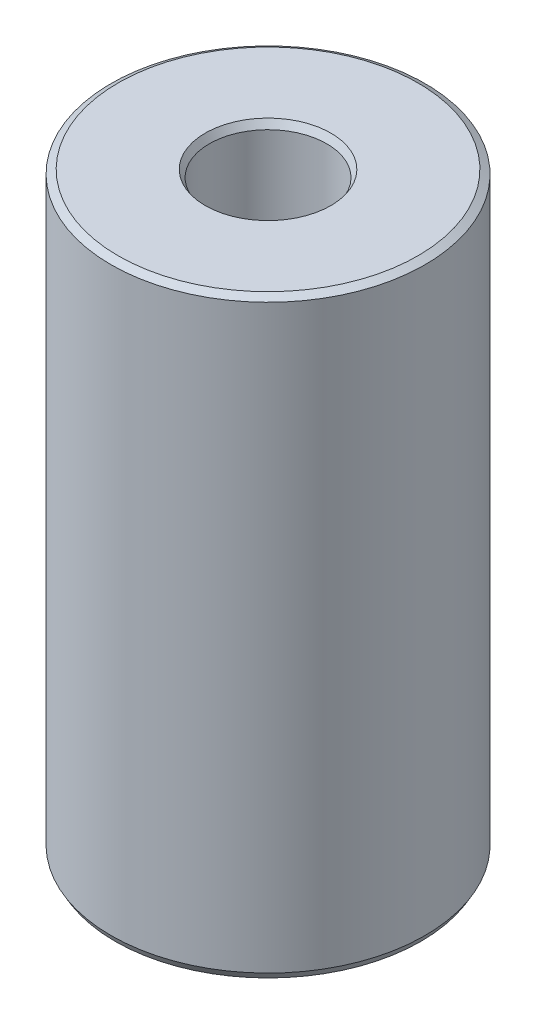
ISO-10303-21;
HEADER;
FILE_DESCRIPTION(('STEP AP214'),'2;1');
FILE_NAME('part.step','',(''),(''),'','','');
FILE_SCHEMA(('AUTOMOTIVE_DESIGN { 1 0 10303 214 1 1 1 1 }'));
ENDSEC;
DATA;
#1=APPLICATION_CONTEXT('core data for automotive mechanical design processes');
#2=APPLICATION_PROTOCOL_DEFINITION('international standard','automotive_design',2000,#1);
#3=PRODUCT_CONTEXT('',#1,'mechanical');
#4=PRODUCT('Part','Part','',(#3));
#5=PRODUCT_RELATED_PRODUCT_CATEGORY('part','',(#4));
#6=PRODUCT_DEFINITION_FORMATION('','',#4);
#7=PRODUCT_DEFINITION_CONTEXT('part definition',#1,'design');
#8=PRODUCT_DEFINITION('design','',#6,#7);
#9=PRODUCT_DEFINITION_SHAPE('','',#8);
#10=(LENGTH_UNIT() NAMED_UNIT(*) SI_UNIT(.MILLI.,.METRE.));
#11=(NAMED_UNIT(*) PLANE_ANGLE_UNIT() SI_UNIT($,.RADIAN.));
#12=(NAMED_UNIT(*) SI_UNIT($,.STERADIAN.) SOLID_ANGLE_UNIT());
#13=UNCERTAINTY_MEASURE_WITH_UNIT(LENGTH_MEASURE(1.E-05),#10,'distance_accuracy_value','');
#14=(GEOMETRIC_REPRESENTATION_CONTEXT(3) GLOBAL_UNCERTAINTY_ASSIGNED_CONTEXT((#13)) GLOBAL_UNIT_ASSIGNED_CONTEXT((#10,
#11,#12)) REPRESENTATION_CONTEXT('',''));
#15=CARTESIAN_POINT('',(0.,0.,0.));
#16=DIRECTION('',(0.,0.,1.));
#17=DIRECTION('',(1.,0.,0.));
#18=AXIS2_PLACEMENT_3D('',#15,#16,#17);
#19=CARTESIAN_POINT('',(0.,94.3124489131097,0.));
#20=DIRECTION('',(0.,-1.,0.));
#21=DIRECTION('',(0.,0.,-1.));
#22=AXIS2_PLACEMENT_3D('',#19,#20,#21);
#23=CYLINDRICAL_SURFACE('',#22,25.);
#24=CARTESIAN_POINT('',(0.,1.13805154253697,0.));
#25=DIRECTION('',(0.,1.,0.));
#26=DIRECTION('',(0.,0.,1.));
#27=AXIS2_PLACEMENT_3D('',#24,#25,#26);
#28=CIRCLE('',#27,25.);
#29=CARTESIAN_POINT('',(0.,1.13805154253697,25.));
#30=VERTEX_POINT('',#29);
#31=EDGE_CURVE('E10',#30,#30,#28,.T.);
#32=ORIENTED_EDGE('',*,*,#31,.T.);
#33=EDGE_LOOP('',(#32));
#34=FACE_BOUND('',#33,.T.);
#35=CARTESIAN_POINT('',(0.,93.6553945486743,0.));
#36=DIRECTION('',(0.,1.,0.));
#37=DIRECTION('',(0.,0.,1.));
#38=AXIS2_PLACEMENT_3D('',#35,#36,#37);
#39=CIRCLE('',#38,25.);
#40=CARTESIAN_POINT('',(0.,93.6553945486743,25.));
#41=VERTEX_POINT('',#40);
#42=EDGE_CURVE('E50',#41,#41,#39,.F.);
#43=ORIENTED_EDGE('',*,*,#42,.T.);
#44=EDGE_LOOP('',(#43));
#45=FACE_BOUND('',#44,.T.);
#46=ADVANCED_FACE('F39',(#34,#45),#23,.T.);
#47=CARTESIAN_POINT('',(0.,94.3124489131097,0.));
#48=DIRECTION('',(0.,1.,0.));
#49=DIRECTION('',(0.,0.,1.));
#50=AXIS2_PLACEMENT_3D('',#47,#48,#49);
#51=PLANE('',#50);
#52=CARTESIAN_POINT('',(0.,94.3124489131097,0.));
#53=DIRECTION('',(0.,1.,0.));
#54=DIRECTION('',(0.,0.,1.));
#55=AXIS2_PLACEMENT_3D('',#52,#53,#54);
#56=CIRCLE('',#55,10.0050318906626);
#57=CARTESIAN_POINT('',(0.,94.3124489131097,10.0050318906626));
#58=VERTEX_POINT('',#57);
#59=EDGE_CURVE('E58',#58,#58,#56,.F.);
#60=ORIENTED_EDGE('',*,*,#59,.T.);
#61=EDGE_LOOP('',(#60));
#62=FACE_BOUND('',#61,.T.);
#63=CARTESIAN_POINT('',(0.,94.3124489131097,0.));
#64=DIRECTION('',(0.,1.,0.));
#65=DIRECTION('',(0.,0.,1.));
#66=AXIS2_PLACEMENT_3D('',#63,#64,#65);
#67=CIRCLE('',#66,23.8619484574631);
#68=CARTESIAN_POINT('',(0.,94.3124489131097,23.8619484574631));
#69=VERTEX_POINT('',#68);
#70=EDGE_CURVE('E61',#69,#69,#67,.T.);
#71=ORIENTED_EDGE('',*,*,#70,.T.);
#72=EDGE_LOOP('',(#71));
#73=FACE_BOUND('',#72,.T.);
#74=ADVANCED_FACE('F88',(#62,#73),#51,.T.);
#75=CARTESIAN_POINT('',(0.,0.,0.));
#76=DIRECTION('',(0.,1.,0.));
#77=DIRECTION('',(0.,0.,1.));
#78=AXIS2_PLACEMENT_3D('',#75,#76,#77);
#79=PLANE('',#78);
#80=CARTESIAN_POINT('',(0.,0.,0.));
#81=DIRECTION('',(0.,1.,0.));
#82=DIRECTION('',(0.,0.,1.));
#83=AXIS2_PLACEMENT_3D('',#80,#81,#82);
#84=CIRCLE('',#83,10.4860290687641);
#85=CARTESIAN_POINT('',(0.,0.,10.4860290687641));
#86=VERTEX_POINT('',#85);
#87=EDGE_CURVE('E51',#86,#86,#84,.T.);
#88=ORIENTED_EDGE('',*,*,#87,.T.);
#89=EDGE_LOOP('',(#88));
#90=FACE_BOUND('',#89,.T.);
#91=CARTESIAN_POINT('',(0.,0.,0.));
#92=DIRECTION('',(0.,1.,0.));
#93=DIRECTION('',(0.,0.,1.));
#94=AXIS2_PLACEMENT_3D('',#91,#92,#93);
#95=CIRCLE('',#94,24.3429456355646);
#96=CARTESIAN_POINT('',(0.,0.,24.3429456355646));
#97=VERTEX_POINT('',#96);
#98=EDGE_CURVE('E54',#97,#97,#95,.F.);
#99=ORIENTED_EDGE('',*,*,#98,.T.);
#100=EDGE_LOOP('',(#99));
#101=FACE_BOUND('',#100,.T.);
#102=ADVANCED_FACE('F83',(#90,#101),#79,.F.);
#103=CARTESIAN_POINT('',(0.,94.3124489131097,0.));
#104=DIRECTION('',(0.,-1.,0.));
#105=DIRECTION('',(0.,0.,-1.));
#106=AXIS2_PLACEMENT_3D('',#103,#104,#105);
#107=CYLINDRICAL_SURFACE('',#106,9.34797752622719);
#108=CARTESIAN_POINT('',(0.,93.1743973705728,0.));
#109=DIRECTION('',(0.,1.,0.));
#110=DIRECTION('',(0.,0.,1.));
#111=AXIS2_PLACEMENT_3D('',#108,#109,#110);
#112=CIRCLE('',#111,9.34797752622719);
#113=CARTESIAN_POINT('',(0.,93.1743973705728,9.34797752622719));
#114=VERTEX_POINT('',#113);
#115=EDGE_CURVE('E67',#114,#114,#112,.T.);
#116=ORIENTED_EDGE('',*,*,#115,.T.);
#117=EDGE_LOOP('',(#116));
#118=FACE_BOUND('',#117,.T.);
#119=CARTESIAN_POINT('',(0.,0.657054364435361,0.));
#120=DIRECTION('',(0.,1.,0.));
#121=DIRECTION('',(0.,0.,1.));
#122=AXIS2_PLACEMENT_3D('',#119,#120,#121);
#123=CIRCLE('',#122,9.34797752622719);
#124=CARTESIAN_POINT('',(0.,0.657054364435361,9.34797752622719));
#125=VERTEX_POINT('',#124);
#126=EDGE_CURVE('E69',#125,#125,#123,.F.);
#127=ORIENTED_EDGE('',*,*,#126,.T.);
#128=EDGE_LOOP('',(#127));
#129=FACE_BOUND('',#128,.T.);
#130=ADVANCED_FACE('F71',(#118,#129),#107,.F.);
#131=CARTESIAN_POINT('',(0.,93.1743973705728,0.));
#132=DIRECTION('',(0.,1.,0.));
#133=DIRECTION('',(0.,0.,1.));
#134=AXIS2_PLACEMENT_3D('',#131,#132,#133);
#135=CONICAL_SURFACE('',#134,9.34797752622719,0.523598775598301);
#136=ORIENTED_EDGE('',*,*,#59,.F.);
#137=EDGE_LOOP('',(#136));
#138=FACE_BOUND('',#137,.T.);
#139=ORIENTED_EDGE('',*,*,#115,.F.);
#140=EDGE_LOOP('',(#139));
#141=FACE_BOUND('',#140,.T.);
#142=ADVANCED_FACE('F77',(#138,#141),#135,.F.);
#143=CARTESIAN_POINT('',(0.,0.,0.));
#144=DIRECTION('',(0.,-1.,0.));
#145=DIRECTION('',(0.,0.,-1.));
#146=AXIS2_PLACEMENT_3D('',#143,#144,#145);
#147=CONICAL_SURFACE('',#146,10.4860290687641,1.0471975511966);
#148=ORIENTED_EDGE('',*,*,#126,.F.);
#149=EDGE_LOOP('',(#148));
#150=FACE_BOUND('',#149,.T.);
#151=ORIENTED_EDGE('',*,*,#87,.F.);
#152=EDGE_LOOP('',(#151));
#153=FACE_BOUND('',#152,.T.);
#154=ADVANCED_FACE('F73',(#150,#153),#147,.F.);
#155=CARTESIAN_POINT('',(0.,1.13805154253697,0.));
#156=DIRECTION('',(0.,1.,0.));
#157=DIRECTION('',(0.,0.,1.));
#158=AXIS2_PLACEMENT_3D('',#155,#156,#157);
#159=CONICAL_SURFACE('',#158,25.,0.523598775598297);
#160=ORIENTED_EDGE('',*,*,#98,.F.);
#161=EDGE_LOOP('',(#160));
#162=FACE_BOUND('',#161,.T.);
#163=ORIENTED_EDGE('',*,*,#31,.F.);
#164=EDGE_LOOP('',(#163));
#165=FACE_BOUND('',#164,.T.);
#166=ADVANCED_FACE('F76',(#162,#165),#159,.T.);
#167=CARTESIAN_POINT('',(0.,94.3124489131097,0.));
#168=DIRECTION('',(0.,-1.,0.));
#169=DIRECTION('',(0.,0.,-1.));
#170=AXIS2_PLACEMENT_3D('',#167,#168,#169);
#171=CONICAL_SURFACE('',#170,23.8619484574631,1.04719755119659);
#172=ORIENTED_EDGE('',*,*,#42,.F.);
#173=EDGE_LOOP('',(#172));
#174=FACE_BOUND('',#173,.T.);
#175=ORIENTED_EDGE('',*,*,#70,.F.);
#176=EDGE_LOOP('',(#175));
#177=FACE_BOUND('',#176,.T.);
#178=ADVANCED_FACE('F45',(#174,#177),#171,.T.);
#179=CLOSED_SHELL('',(#46,#74,#102,#130,#142,#154,#166,#178));
#180=MANIFOLD_SOLID_BREP('B2',#179);
#181=ADVANCED_BREP_SHAPE_REPRESENTATION('',(#18,#180),#14);
#182=SHAPE_DEFINITION_REPRESENTATION(#9,#181);
ENDSEC;
END-ISO-10303-21;
